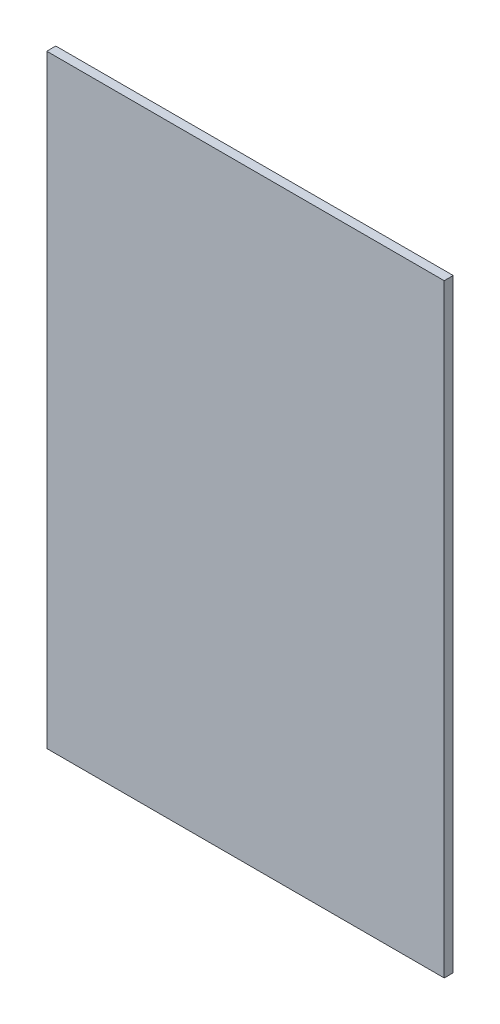
ISO-10303-21;
HEADER;
FILE_DESCRIPTION(('STEP AP214'),'2;1');
FILE_NAME('part.step','',(''),(''),'','','');
FILE_SCHEMA(('AUTOMOTIVE_DESIGN { 1 0 10303 214 1 1 1 1 }'));
ENDSEC;
DATA;
#1=APPLICATION_CONTEXT('core data for automotive mechanical design processes');
#2=APPLICATION_PROTOCOL_DEFINITION('international standard','automotive_design',2000,#1);
#3=PRODUCT_CONTEXT('',#1,'mechanical');
#4=PRODUCT('Part','Part','',(#3));
#5=PRODUCT_RELATED_PRODUCT_CATEGORY('part','',(#4));
#6=PRODUCT_DEFINITION_FORMATION('','',#4);
#7=PRODUCT_DEFINITION_CONTEXT('part definition',#1,'design');
#8=PRODUCT_DEFINITION('design','',#6,#7);
#9=PRODUCT_DEFINITION_SHAPE('','',#8);
#10=(LENGTH_UNIT() NAMED_UNIT(*) SI_UNIT(.MILLI.,.METRE.));
#11=(NAMED_UNIT(*) PLANE_ANGLE_UNIT() SI_UNIT($,.RADIAN.));
#12=(NAMED_UNIT(*) SI_UNIT($,.STERADIAN.) SOLID_ANGLE_UNIT());
#13=UNCERTAINTY_MEASURE_WITH_UNIT(LENGTH_MEASURE(1.E-05),#10,'distance_accuracy_value','');
#14=(GEOMETRIC_REPRESENTATION_CONTEXT(3) GLOBAL_UNCERTAINTY_ASSIGNED_CONTEXT((#13)) GLOBAL_UNIT_ASSIGNED_CONTEXT((#10,
#11,#12)) REPRESENTATION_CONTEXT('',''));
#15=CARTESIAN_POINT('',(0.,0.,0.));
#16=DIRECTION('',(0.,0.,1.));
#17=DIRECTION('',(1.,0.,0.));
#18=AXIS2_PLACEMENT_3D('',#15,#16,#17);
#19=CARTESIAN_POINT('',(88.1999999999999,-134.,4.));
#20=DIRECTION('',(-1.,0.,0.));
#21=DIRECTION('',(0.,0.,1.));
#22=AXIS2_PLACEMENT_3D('',#19,#20,#21);
#23=PLANE('',#22);
#24=DIRECTION('',(0.,1.,0.));
#25=VECTOR('',#24,1.);
#26=CARTESIAN_POINT('',(88.1999999999999,-134.,0.));
#27=LINE('',#26,#25);
#28=CARTESIAN_POINT('',(88.1999999999999,-134.,0.));
#29=VERTEX_POINT('',#28);
#30=CARTESIAN_POINT('',(88.1999999999999,134.,0.));
#31=VERTEX_POINT('',#30);
#32=EDGE_CURVE('E97',#29,#31,#27,.T.);
#33=ORIENTED_EDGE('',*,*,#32,.T.);
#34=DIRECTION('',(0.,0.,-1.));
#35=VECTOR('',#34,1.);
#36=CARTESIAN_POINT('',(88.1999999999999,134.,4.));
#37=LINE('',#36,#35);
#38=CARTESIAN_POINT('',(88.1999999999999,134.,4.));
#39=VERTEX_POINT('',#38);
#40=EDGE_CURVE('E11',#39,#31,#37,.T.);
#41=ORIENTED_EDGE('',*,*,#40,.F.);
#42=DIRECTION('',(0.,1.,0.));
#43=VECTOR('',#42,1.);
#44=CARTESIAN_POINT('',(88.1999999999999,-134.,4.));
#45=LINE('',#44,#43);
#46=CARTESIAN_POINT('',(88.1999999999999,-134.,4.));
#47=VERTEX_POINT('',#46);
#48=EDGE_CURVE('E85',#47,#39,#45,.T.);
#49=ORIENTED_EDGE('',*,*,#48,.F.);
#50=DIRECTION('',(0.,0.,-1.));
#51=VECTOR('',#50,1.);
#52=CARTESIAN_POINT('',(88.1999999999999,-134.,4.));
#53=LINE('',#52,#51);
#54=EDGE_CURVE('E93',#47,#29,#53,.T.);
#55=ORIENTED_EDGE('',*,*,#54,.T.);
#56=EDGE_LOOP('',(#33,#41,#49,#55));
#57=FACE_BOUND('',#56,.T.);
#58=ADVANCED_FACE('F34',(#57),#23,.F.);
#59=CARTESIAN_POINT('',(-88.1999999999999,134.,4.));
#60=DIRECTION('',(0.,-1.,0.));
#61=DIRECTION('',(0.,0.,-1.));
#62=AXIS2_PLACEMENT_3D('',#59,#60,#61);
#63=PLANE('',#62);
#64=DIRECTION('',(-1.,0.,0.));
#65=VECTOR('',#64,1.);
#66=CARTESIAN_POINT('',(-88.1999999999999,134.,0.));
#67=LINE('',#66,#65);
#68=CARTESIAN_POINT('',(-88.1999999999999,134.,0.));
#69=VERTEX_POINT('',#68);
#70=EDGE_CURVE('E89',#31,#69,#67,.T.);
#71=ORIENTED_EDGE('',*,*,#70,.T.);
#72=DIRECTION('',(0.,0.,-1.));
#73=VECTOR('',#72,1.);
#74=CARTESIAN_POINT('',(-88.1999999999999,134.,4.));
#75=LINE('',#74,#73);
#76=CARTESIAN_POINT('',(-88.1999999999999,134.,4.));
#77=VERTEX_POINT('',#76);
#78=EDGE_CURVE('E42',#77,#69,#75,.T.);
#79=ORIENTED_EDGE('',*,*,#78,.F.);
#80=DIRECTION('',(-1.,0.,0.));
#81=VECTOR('',#80,1.);
#82=CARTESIAN_POINT('',(-88.1999999999999,134.,4.));
#83=LINE('',#82,#81);
#84=EDGE_CURVE('E80',#39,#77,#83,.T.);
#85=ORIENTED_EDGE('',*,*,#84,.F.);
#86=ORIENTED_EDGE('',*,*,#40,.T.);
#87=EDGE_LOOP('',(#71,#79,#85,#86));
#88=FACE_BOUND('',#87,.T.);
#89=ADVANCED_FACE('F88',(#88),#63,.F.);
#90=CARTESIAN_POINT('',(-88.1999999999999,-134.,4.));
#91=DIRECTION('',(1.,0.,0.));
#92=DIRECTION('',(0.,0.,-1.));
#93=AXIS2_PLACEMENT_3D('',#90,#91,#92);
#94=PLANE('',#93);
#95=DIRECTION('',(0.,-1.,0.));
#96=VECTOR('',#95,1.);
#97=CARTESIAN_POINT('',(-88.1999999999999,-134.,0.));
#98=LINE('',#97,#96);
#99=CARTESIAN_POINT('',(-88.1999999999999,-134.,0.));
#100=VERTEX_POINT('',#99);
#101=EDGE_CURVE('E67',#69,#100,#98,.T.);
#102=ORIENTED_EDGE('',*,*,#101,.T.);
#103=DIRECTION('',(0.,0.,-1.));
#104=VECTOR('',#103,1.);
#105=CARTESIAN_POINT('',(-88.1999999999999,-134.,4.));
#106=LINE('',#105,#104);
#107=CARTESIAN_POINT('',(-88.1999999999999,-134.,4.));
#108=VERTEX_POINT('',#107);
#109=EDGE_CURVE('E90',#108,#100,#106,.T.);
#110=ORIENTED_EDGE('',*,*,#109,.F.);
#111=DIRECTION('',(0.,-1.,0.));
#112=VECTOR('',#111,1.);
#113=CARTESIAN_POINT('',(-88.1999999999999,-134.,4.));
#114=LINE('',#113,#112);
#115=EDGE_CURVE('E83',#77,#108,#114,.T.);
#116=ORIENTED_EDGE('',*,*,#115,.F.);
#117=ORIENTED_EDGE('',*,*,#78,.T.);
#118=EDGE_LOOP('',(#102,#110,#116,#117));
#119=FACE_BOUND('',#118,.T.);
#120=ADVANCED_FACE('F91',(#119),#94,.F.);
#121=CARTESIAN_POINT('',(-88.1999999999999,-134.,4.));
#122=DIRECTION('',(0.,1.,0.));
#123=DIRECTION('',(0.,0.,1.));
#124=AXIS2_PLACEMENT_3D('',#121,#122,#123);
#125=PLANE('',#124);
#126=DIRECTION('',(1.,0.,0.));
#127=VECTOR('',#126,1.);
#128=CARTESIAN_POINT('',(-88.1999999999999,-134.,0.));
#129=LINE('',#128,#127);
#130=EDGE_CURVE('E73',#100,#29,#129,.T.);
#131=ORIENTED_EDGE('',*,*,#130,.T.);
#132=ORIENTED_EDGE('',*,*,#54,.F.);
#133=DIRECTION('',(1.,0.,0.));
#134=VECTOR('',#133,1.);
#135=CARTESIAN_POINT('',(-88.1999999999999,-134.,4.));
#136=LINE('',#135,#134);
#137=EDGE_CURVE('E50',#108,#47,#136,.T.);
#138=ORIENTED_EDGE('',*,*,#137,.F.);
#139=ORIENTED_EDGE('',*,*,#109,.T.);
#140=EDGE_LOOP('',(#131,#132,#138,#139));
#141=FACE_BOUND('',#140,.T.);
#142=ADVANCED_FACE('F104',(#141),#125,.F.);
#143=CARTESIAN_POINT('',(0.,0.,4.));
#144=DIRECTION('',(0.,0.,-1.));
#145=DIRECTION('',(-1.,0.,0.));
#146=AXIS2_PLACEMENT_3D('',#143,#144,#145);
#147=PLANE('',#146);
#148=ORIENTED_EDGE('',*,*,#48,.T.);
#149=ORIENTED_EDGE('',*,*,#84,.T.);
#150=ORIENTED_EDGE('',*,*,#115,.T.);
#151=ORIENTED_EDGE('',*,*,#137,.T.);
#152=EDGE_LOOP('',(#148,#149,#150,#151));
#153=FACE_BOUND('',#152,.T.);
#154=ADVANCED_FACE('F81',(#153),#147,.F.);
#155=CARTESIAN_POINT('',(0.,0.,0.));
#156=DIRECTION('',(0.,0.,-1.));
#157=DIRECTION('',(-1.,0.,0.));
#158=AXIS2_PLACEMENT_3D('',#155,#156,#157);
#159=PLANE('',#158);
#160=ORIENTED_EDGE('',*,*,#32,.F.);
#161=ORIENTED_EDGE('',*,*,#130,.F.);
#162=ORIENTED_EDGE('',*,*,#101,.F.);
#163=ORIENTED_EDGE('',*,*,#70,.F.);
#164=EDGE_LOOP('',(#160,#161,#162,#163));
#165=FACE_BOUND('',#164,.T.);
#166=ADVANCED_FACE('F107',(#165),#159,.T.);
#167=CLOSED_SHELL('',(#58,#89,#120,#142,#154,#166));
#168=MANIFOLD_SOLID_BREP('B2',#167);
#169=ADVANCED_BREP_SHAPE_REPRESENTATION('',(#18,#168),#14);
#170=SHAPE_DEFINITION_REPRESENTATION(#9,#169);
ENDSEC;
END-ISO-10303-21;
